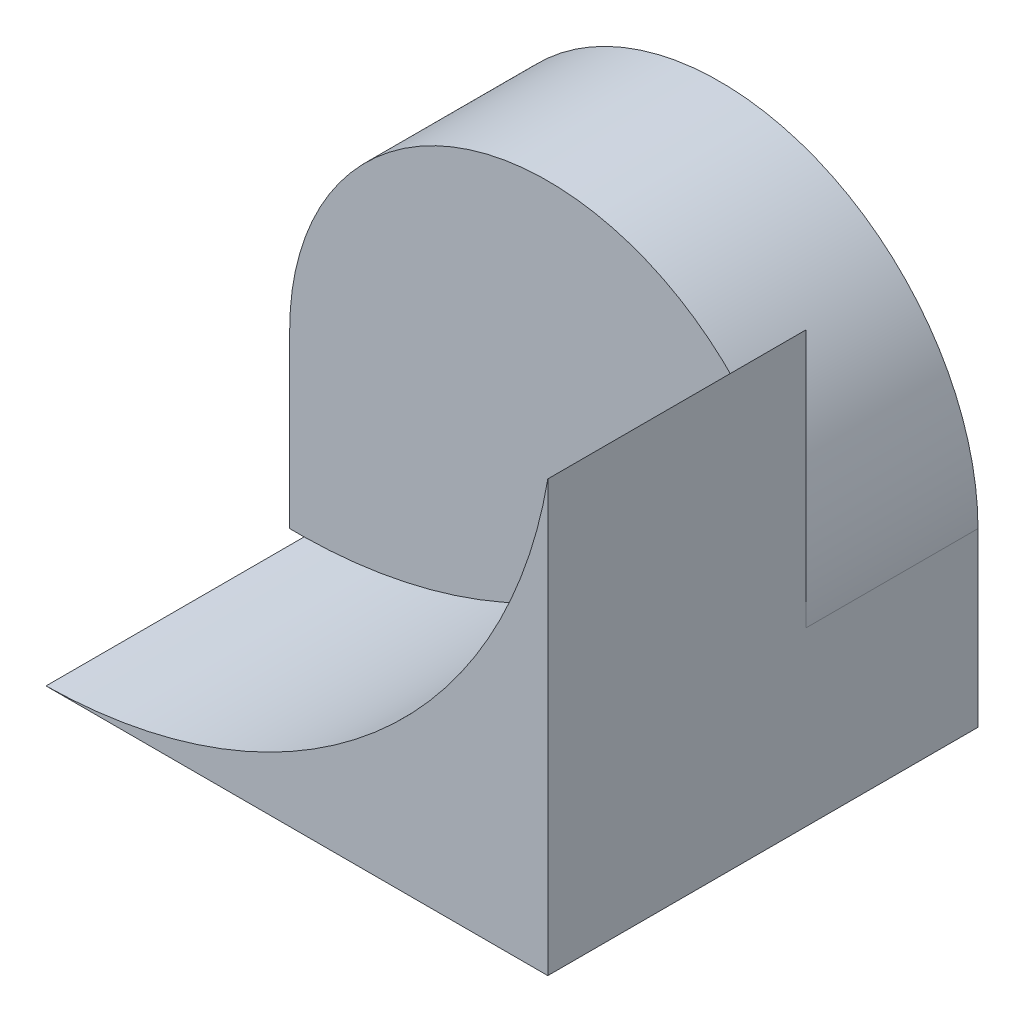
ISO-10303-21;
HEADER;
FILE_DESCRIPTION(('STEP AP214'),'2;1');
FILE_NAME('part.step','',(''),(''),'','','');
FILE_SCHEMA(('AUTOMOTIVE_DESIGN { 1 0 10303 214 1 1 1 1 }'));
ENDSEC;
DATA;
#1=APPLICATION_CONTEXT('core data for automotive mechanical design processes');
#2=APPLICATION_PROTOCOL_DEFINITION('international standard','automotive_design',2000,#1);
#3=PRODUCT_CONTEXT('',#1,'mechanical');
#4=PRODUCT('Part','Part','',(#3));
#5=PRODUCT_RELATED_PRODUCT_CATEGORY('part','',(#4));
#6=PRODUCT_DEFINITION_FORMATION('','',#4);
#7=PRODUCT_DEFINITION_CONTEXT('part definition',#1,'design');
#8=PRODUCT_DEFINITION('design','',#6,#7);
#9=PRODUCT_DEFINITION_SHAPE('','',#8);
#10=(LENGTH_UNIT() NAMED_UNIT(*) SI_UNIT(.MILLI.,.METRE.));
#11=(NAMED_UNIT(*) PLANE_ANGLE_UNIT() SI_UNIT($,.RADIAN.));
#12=(NAMED_UNIT(*) SI_UNIT($,.STERADIAN.) SOLID_ANGLE_UNIT());
#13=UNCERTAINTY_MEASURE_WITH_UNIT(LENGTH_MEASURE(1.E-05),#10,'distance_accuracy_value','');
#14=(GEOMETRIC_REPRESENTATION_CONTEXT(3) GLOBAL_UNCERTAINTY_ASSIGNED_CONTEXT((#13)) GLOBAL_UNIT_ASSIGNED_CONTEXT((#10,
#11,#12)) REPRESENTATION_CONTEXT('',''));
#15=CARTESIAN_POINT('',(0.,0.,0.));
#16=DIRECTION('',(0.,0.,1.));
#17=DIRECTION('',(1.,0.,0.));
#18=AXIS2_PLACEMENT_3D('',#15,#16,#17);
#19=CARTESIAN_POINT('',(0.,0.,10.));
#20=DIRECTION('',(0.,1.,0.));
#21=DIRECTION('',(-1.,0.,0.));
#22=AXIS2_PLACEMENT_3D('',#19,#20,#21);
#23=PLANE('',#22);
#24=DIRECTION('',(1.,0.,0.));
#25=VECTOR('',#24,1.);
#26=CARTESIAN_POINT('',(0.,0.,0.));
#27=LINE('',#26,#25);
#28=CARTESIAN_POINT('',(-30.,0.,0.));
#29=VERTEX_POINT('',#28);
#30=CARTESIAN_POINT('',(0.,0.,0.));
#31=VERTEX_POINT('',#30);
#32=EDGE_CURVE('E94',#29,#31,#27,.T.);
#33=ORIENTED_EDGE('',*,*,#32,.T.);
#34=DIRECTION('',(0.,0.,-1.));
#35=VECTOR('',#34,1.);
#36=CARTESIAN_POINT('',(0.,0.,10.));
#37=LINE('',#36,#35);
#38=CARTESIAN_POINT('',(0.,0.,25.));
#39=VERTEX_POINT('',#38);
#40=EDGE_CURVE('E11',#39,#31,#37,.T.);
#41=ORIENTED_EDGE('',*,*,#40,.F.);
#42=DIRECTION('',(1.,0.,0.));
#43=VECTOR('',#42,1.);
#44=CARTESIAN_POINT('',(0.,0.,25.));
#45=LINE('',#44,#43);
#46=CARTESIAN_POINT('',(-29.1617872577379,0.,25.));
#47=VERTEX_POINT('',#46);
#48=EDGE_CURVE('E147',#47,#39,#45,.T.);
#49=ORIENTED_EDGE('',*,*,#48,.F.);
#50=DIRECTION('',(0.,0.,-1.));
#51=VECTOR('',#50,1.);
#52=CARTESIAN_POINT('',(-29.1617872577379,0.,25.));
#53=LINE('',#52,#51);
#54=CARTESIAN_POINT('',(-29.1617872577379,0.,10.));
#55=VERTEX_POINT('',#54);
#56=EDGE_CURVE('E99',#47,#55,#53,.T.);
#57=ORIENTED_EDGE('',*,*,#56,.T.);
#58=DIRECTION('',(1.,0.,0.));
#59=VECTOR('',#58,1.);
#60=CARTESIAN_POINT('',(0.,0.,10.));
#61=LINE('',#60,#59);
#62=CARTESIAN_POINT('',(-30.,0.,10.));
#63=VERTEX_POINT('',#62);
#64=EDGE_CURVE('E88',#63,#55,#61,.T.);
#65=ORIENTED_EDGE('',*,*,#64,.F.);
#66=DIRECTION('',(0.,0.,-1.));
#67=VECTOR('',#66,1.);
#68=CARTESIAN_POINT('',(-30.,0.,10.));
#69=LINE('',#68,#67);
#70=EDGE_CURVE('E81',#63,#29,#69,.T.);
#71=ORIENTED_EDGE('',*,*,#70,.T.);
#72=EDGE_LOOP('',(#33,#41,#49,#57,#65,#71));
#73=FACE_BOUND('',#72,.T.);
#74=ADVANCED_FACE('F33',(#73),#23,.F.);
#75=CARTESIAN_POINT('',(0.,10.,10.));
#76=DIRECTION('',(-1.,0.,0.));
#77=DIRECTION('',(0.,0.,1.));
#78=AXIS2_PLACEMENT_3D('',#75,#76,#77);
#79=PLANE('',#78);
#80=DIRECTION('',(0.,1.,0.));
#81=VECTOR('',#80,1.);
#82=CARTESIAN_POINT('',(0.,10.,0.));
#83=LINE('',#82,#81);
#84=CARTESIAN_POINT('',(0.,10.,0.));
#85=VERTEX_POINT('',#84);
#86=EDGE_CURVE('E98',#31,#85,#83,.T.);
#87=ORIENTED_EDGE('',*,*,#86,.T.);
#88=DIRECTION('',(0.,0.,-1.));
#89=VECTOR('',#88,1.);
#90=CARTESIAN_POINT('',(0.,10.,10.));
#91=LINE('',#90,#89);
#92=CARTESIAN_POINT('',(0.,10.,10.));
#93=VERTEX_POINT('',#92);
#94=EDGE_CURVE('E42',#93,#85,#91,.T.);
#95=ORIENTED_EDGE('',*,*,#94,.F.);
#96=DIRECTION('',(0.,1.,0.));
#97=VECTOR('',#96,1.);
#98=CARTESIAN_POINT('',(0.,0.,10.));
#99=LINE('',#98,#97);
#100=CARTESIAN_POINT('',(0.,25.,10.));
#101=VERTEX_POINT('',#100);
#102=EDGE_CURVE('E113',#93,#101,#99,.T.);
#103=ORIENTED_EDGE('',*,*,#102,.T.);
#104=DIRECTION('',(0.,0.,-1.));
#105=VECTOR('',#104,1.);
#106=CARTESIAN_POINT('',(0.,25.,25.));
#107=LINE('',#106,#105);
#108=CARTESIAN_POINT('',(0.,25.,25.));
#109=VERTEX_POINT('',#108);
#110=EDGE_CURVE('E102',#109,#101,#107,.T.);
#111=ORIENTED_EDGE('',*,*,#110,.F.);
#112=DIRECTION('',(0.,1.,0.));
#113=VECTOR('',#112,1.);
#114=CARTESIAN_POINT('',(0.,0.,25.));
#115=LINE('',#114,#113);
#116=EDGE_CURVE('E141',#39,#109,#115,.T.);
#117=ORIENTED_EDGE('',*,*,#116,.F.);
#118=ORIENTED_EDGE('',*,*,#40,.T.);
#119=EDGE_LOOP('',(#87,#95,#103,#111,#117,#118));
#120=FACE_BOUND('',#119,.T.);
#121=ADVANCED_FACE('F157',(#120),#79,.F.);
#122=CARTESIAN_POINT('',(-15.,10.,10.));
#123=DIRECTION('',(0.,0.,-1.));
#124=DIRECTION('',(-1.,0.,0.));
#125=AXIS2_PLACEMENT_3D('',#122,#123,#124);
#126=CYLINDRICAL_SURFACE('',#125,15.);
#127=CARTESIAN_POINT('',(-15.,10.,0.));
#128=DIRECTION('',(0.,0.,1.));
#129=DIRECTION('',(-1.,0.,0.));
#130=AXIS2_PLACEMENT_3D('',#127,#128,#129);
#131=CIRCLE('',#130,15.);
#132=CARTESIAN_POINT('',(-30.,10.,0.));
#133=VERTEX_POINT('',#132);
#134=EDGE_CURVE('E89',#85,#133,#131,.T.);
#135=ORIENTED_EDGE('',*,*,#134,.T.);
#136=DIRECTION('',(0.,0.,-1.));
#137=VECTOR('',#136,1.);
#138=CARTESIAN_POINT('',(-30.,10.,10.));
#139=LINE('',#138,#137);
#140=CARTESIAN_POINT('',(-30.,10.,10.));
#141=VERTEX_POINT('',#140);
#142=EDGE_CURVE('E84',#141,#133,#139,.T.);
#143=ORIENTED_EDGE('',*,*,#142,.F.);
#144=CARTESIAN_POINT('',(-15.,10.,10.));
#145=DIRECTION('',(0.,0.,1.));
#146=DIRECTION('',(-1.,0.,0.));
#147=AXIS2_PLACEMENT_3D('',#144,#145,#146);
#148=CIRCLE('',#147,15.);
#149=CARTESIAN_POINT('',(-2.17872434548071,17.7855565370005,10.));
#150=VERTEX_POINT('',#149);
#151=EDGE_CURVE('E109',#150,#141,#148,.T.);
#152=ORIENTED_EDGE('',*,*,#151,.F.);
#153=EDGE_CURVE('E36',#93,#150,#148,.T.);
#154=ORIENTED_EDGE('',*,*,#153,.F.);
#155=ORIENTED_EDGE('',*,*,#94,.T.);
#156=EDGE_LOOP('',(#135,#143,#152,#154,#155));
#157=FACE_BOUND('',#156,.T.);
#158=ADVANCED_FACE('F133',(#157),#126,.T.);
#159=CARTESIAN_POINT('',(-30.,0.,10.));
#160=DIRECTION('',(1.,0.,0.));
#161=DIRECTION('',(0.,0.,-1.));
#162=AXIS2_PLACEMENT_3D('',#159,#160,#161);
#163=PLANE('',#162);
#164=DIRECTION('',(0.,-1.,0.));
#165=VECTOR('',#164,1.);
#166=CARTESIAN_POINT('',(-30.,0.,0.));
#167=LINE('',#166,#165);
#168=EDGE_CURVE('E78',#133,#29,#167,.T.);
#169=ORIENTED_EDGE('',*,*,#168,.T.);
#170=ORIENTED_EDGE('',*,*,#70,.F.);
#171=DIRECTION('',(0.,-1.,0.));
#172=VECTOR('',#171,1.);
#173=CARTESIAN_POINT('',(-30.,0.,10.));
#174=LINE('',#173,#172);
#175=EDGE_CURVE('E59',#141,#63,#174,.T.);
#176=ORIENTED_EDGE('',*,*,#175,.F.);
#177=ORIENTED_EDGE('',*,*,#142,.T.);
#178=EDGE_LOOP('',(#169,#170,#176,#177));
#179=FACE_BOUND('',#178,.T.);
#180=ADVANCED_FACE('F80',(#179),#163,.F.);
#181=CARTESIAN_POINT('',(-15.,10.,10.));
#182=DIRECTION('',(0.,0.,-1.));
#183=DIRECTION('',(-1.,0.,0.));
#184=AXIS2_PLACEMENT_3D('',#181,#182,#183);
#185=PLANE('',#184);
#186=ORIENTED_EDGE('',*,*,#64,.T.);
#187=CARTESIAN_POINT('',(-29.580893628869,29.9970723546428,10.));
#188=DIRECTION('',(0.,0.,1.));
#189=DIRECTION('',(1.,0.,0.));
#190=AXIS2_PLACEMENT_3D('',#187,#188,#189);
#191=CIRCLE('',#190,30.);
#192=EDGE_CURVE('E128',#55,#150,#191,.T.);
#193=ORIENTED_EDGE('',*,*,#192,.T.);
#194=ORIENTED_EDGE('',*,*,#151,.T.);
#195=ORIENTED_EDGE('',*,*,#175,.T.);
#196=EDGE_LOOP('',(#186,#193,#194,#195));
#197=FACE_BOUND('',#196,.T.);
#198=ADVANCED_FACE('F129',(#197),#185,.F.);
#199=CARTESIAN_POINT('',(-15.,10.,0.));
#200=DIRECTION('',(0.,0.,-1.));
#201=DIRECTION('',(-1.,0.,0.));
#202=AXIS2_PLACEMENT_3D('',#199,#200,#201);
#203=PLANE('',#202);
#204=ORIENTED_EDGE('',*,*,#32,.F.);
#205=ORIENTED_EDGE('',*,*,#168,.F.);
#206=ORIENTED_EDGE('',*,*,#134,.F.);
#207=ORIENTED_EDGE('',*,*,#86,.F.);
#208=EDGE_LOOP('',(#204,#205,#206,#207));
#209=FACE_BOUND('',#208,.T.);
#210=ADVANCED_FACE('F97',(#209),#203,.T.);
#211=CARTESIAN_POINT('',(0.,0.,10.));
#212=DIRECTION('',(0.,0.,1.));
#213=DIRECTION('',(1.,0.,0.));
#214=AXIS2_PLACEMENT_3D('',#211,#212,#213);
#215=PLANE('',#214);
#216=ORIENTED_EDGE('',*,*,#102,.F.);
#217=ORIENTED_EDGE('',*,*,#153,.T.);
#218=EDGE_CURVE('E50',#150,#101,#191,.T.);
#219=ORIENTED_EDGE('',*,*,#218,.T.);
#220=EDGE_LOOP('',(#216,#217,#219));
#221=FACE_BOUND('',#220,.T.);
#222=ADVANCED_FACE('F122',(#221),#215,.F.);
#223=CARTESIAN_POINT('',(-29.580893628869,29.9970723546428,25.));
#224=DIRECTION('',(0.,0.,-1.));
#225=DIRECTION('',(-1.,0.,0.));
#226=AXIS2_PLACEMENT_3D('',#223,#224,#225);
#227=CYLINDRICAL_SURFACE('',#226,30.);
#228=ORIENTED_EDGE('',*,*,#192,.F.);
#229=ORIENTED_EDGE('',*,*,#56,.F.);
#230=CARTESIAN_POINT('',(-29.580893628869,29.9970723546428,25.));
#231=DIRECTION('',(0.,0.,1.));
#232=DIRECTION('',(1.,0.,0.));
#233=AXIS2_PLACEMENT_3D('',#230,#231,#232);
#234=CIRCLE('',#233,30.);
#235=EDGE_CURVE('E153',#47,#109,#234,.T.);
#236=ORIENTED_EDGE('',*,*,#235,.T.);
#237=ORIENTED_EDGE('',*,*,#110,.T.);
#238=ORIENTED_EDGE('',*,*,#218,.F.);
#239=EDGE_LOOP('',(#228,#229,#236,#237,#238));
#240=FACE_BOUND('',#239,.T.);
#241=ADVANCED_FACE('F166',(#240),#227,.F.);
#242=CARTESIAN_POINT('',(0.,0.,25.));
#243=DIRECTION('',(0.,0.,1.));
#244=DIRECTION('',(1.,0.,0.));
#245=AXIS2_PLACEMENT_3D('',#242,#243,#244);
#246=PLANE('',#245);
#247=ORIENTED_EDGE('',*,*,#235,.F.);
#248=ORIENTED_EDGE('',*,*,#48,.T.);
#249=ORIENTED_EDGE('',*,*,#116,.T.);
#250=EDGE_LOOP('',(#247,#248,#249));
#251=FACE_BOUND('',#250,.T.);
#252=ADVANCED_FACE('F164',(#251),#246,.T.);
#253=CLOSED_SHELL('',(#74,#121,#158,#180,#198,#210,#222,#241,#252));
#254=MANIFOLD_SOLID_BREP('B2',#253);
#255=ADVANCED_BREP_SHAPE_REPRESENTATION('',(#18,#254),#14);
#256=SHAPE_DEFINITION_REPRESENTATION(#9,#255);
ENDSEC;
END-ISO-10303-21;
